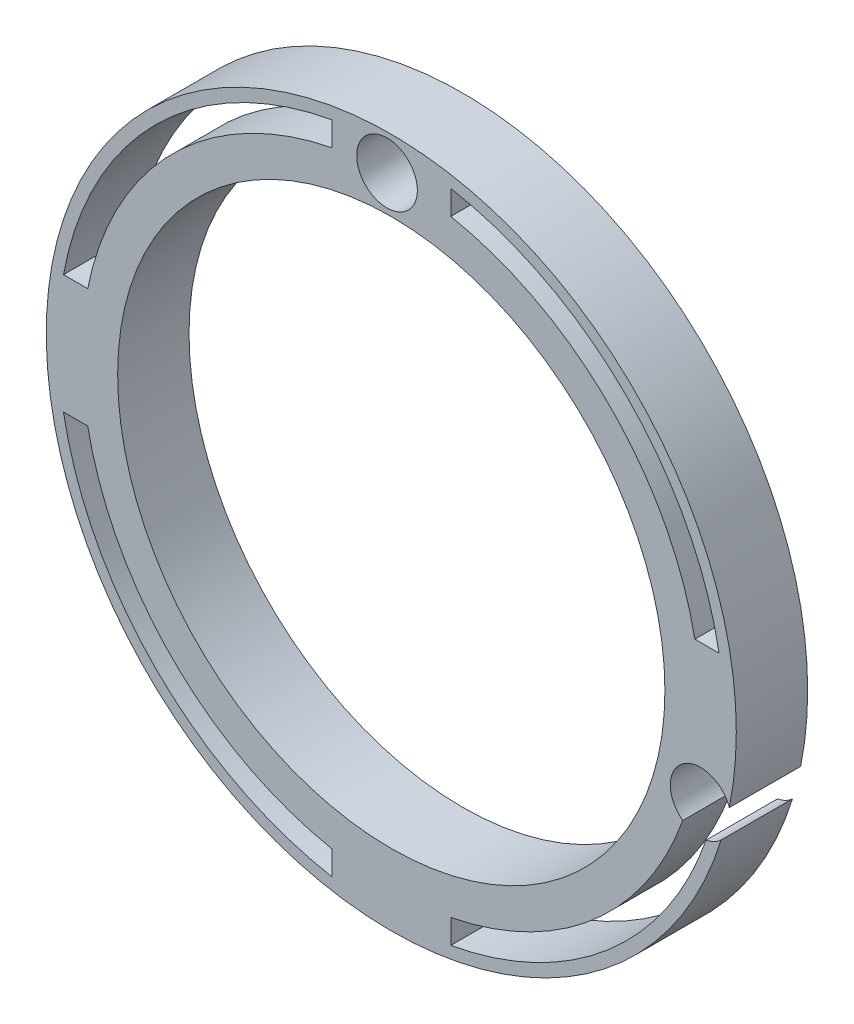
ISO-10303-21;
HEADER;
FILE_DESCRIPTION(('STEP AP214'),'2;1');
FILE_NAME('part.step','',(''),(''),'','','');
FILE_SCHEMA(('AUTOMOTIVE_DESIGN { 1 0 10303 214 1 1 1 1 }'));
ENDSEC;
DATA;
#1=APPLICATION_CONTEXT('core data for automotive mechanical design processes');
#2=APPLICATION_PROTOCOL_DEFINITION('international standard','automotive_design',2000,#1);
#3=PRODUCT_CONTEXT('',#1,'mechanical');
#4=PRODUCT('Part','Part','',(#3));
#5=PRODUCT_RELATED_PRODUCT_CATEGORY('part','',(#4));
#6=PRODUCT_DEFINITION_FORMATION('','',#4);
#7=PRODUCT_DEFINITION_CONTEXT('part definition',#1,'design');
#8=PRODUCT_DEFINITION('design','',#6,#7);
#9=PRODUCT_DEFINITION_SHAPE('','',#8);
#10=(LENGTH_UNIT() NAMED_UNIT(*) SI_UNIT(.MILLI.,.METRE.));
#11=(NAMED_UNIT(*) PLANE_ANGLE_UNIT() SI_UNIT($,.RADIAN.));
#12=(NAMED_UNIT(*) SI_UNIT($,.STERADIAN.) SOLID_ANGLE_UNIT());
#13=UNCERTAINTY_MEASURE_WITH_UNIT(LENGTH_MEASURE(1.E-05),#10,'distance_accuracy_value','');
#14=(GEOMETRIC_REPRESENTATION_CONTEXT(3) GLOBAL_UNCERTAINTY_ASSIGNED_CONTEXT((#13)) GLOBAL_UNIT_ASSIGNED_CONTEXT((#10,
#11,#12)) REPRESENTATION_CONTEXT('',''));
#15=CARTESIAN_POINT('',(0.,0.,0.));
#16=DIRECTION('',(0.,0.,1.));
#17=DIRECTION('',(1.,0.,0.));
#18=AXIS2_PLACEMENT_3D('',#15,#16,#17);
#19=CARTESIAN_POINT('',(259.301545348096,-148.573704322228,22.865));
#20=DIRECTION('',(0.,0.,-1.));
#21=DIRECTION('',(-1.,0.,0.));
#22=AXIS2_PLACEMENT_3D('',#19,#20,#21);
#23=CYLINDRICAL_SURFACE('',#22,27.5);
#24=CARTESIAN_POINT('',(259.301545348096,-148.573704322228,2.));
#25=DIRECTION('',(0.,0.,-1.));
#26=DIRECTION('',(-1.,0.,0.));
#27=AXIS2_PLACEMENT_3D('',#24,#25,#26);
#28=CIRCLE('',#27,27.5);
#29=CARTESIAN_POINT('',(261.04599148136,-121.12908904549,2.));
#30=VERTEX_POINT('',#29);
#31=CARTESIAN_POINT('',(264.301545348096,-121.532069756248,2.));
#32=VERTEX_POINT('',#31);
#33=EDGE_CURVE('E292',#30,#32,#28,.T.);
#34=ORIENTED_EDGE('',*,*,#33,.F.);
#35=DIRECTION('',(0.,0.,1.));
#36=VECTOR('',#35,1.);
#37=CARTESIAN_POINT('',(261.04599148136,-121.12908904549,3.00000000000001));
#38=LINE('',#37,#36);
#39=CARTESIAN_POINT('',(261.04599148136,-121.12908904549,0.));
#40=VERTEX_POINT('',#39);
#41=EDGE_CURVE('E449',#30,#40,#38,.F.);
#42=ORIENTED_EDGE('',*,*,#41,.T.);
#43=CARTESIAN_POINT('',(259.301545348096,-148.573704322228,0.));
#44=DIRECTION('',(0.,0.,-1.));
#45=DIRECTION('',(-1.,0.,0.));
#46=AXIS2_PLACEMENT_3D('',#43,#44,#45);
#47=CIRCLE('',#46,27.5);
#48=CARTESIAN_POINT('',(264.301545348096,-121.532069756248,0.));
#49=VERTEX_POINT('',#48);
#50=EDGE_CURVE('E297',#40,#49,#47,.T.);
#51=ORIENTED_EDGE('',*,*,#50,.T.);
#52=DIRECTION('',(0.,0.,-1.));
#53=VECTOR('',#52,1.);
#54=CARTESIAN_POINT('',(264.301545348096,-121.532069756248,22.865));
#55=LINE('',#54,#53);
#56=EDGE_CURVE('E419',#49,#32,#55,.F.);
#57=ORIENTED_EDGE('',*,*,#56,.T.);
#58=EDGE_LOOP('',(#34,#42,#51,#57));
#59=FACE_BOUND('',#58,.T.);
#60=ADVANCED_FACE('F37',(#59),#23,.F.);
#61=CARTESIAN_POINT('',(259.301545348096,-121.073704322228,2.));
#62=DIRECTION('',(0.,0.,1.));
#63=DIRECTION('',(1.,0.,0.));
#64=AXIS2_PLACEMENT_3D('',#61,#62,#63);
#65=PLANE('',#64);
#66=CARTESIAN_POINT('',(254.301545348096,-121.532069756248,2.));
#67=VERTEX_POINT('',#66);
#68=CARTESIAN_POINT('',(256.804472713702,-121.187309374032,2.));
#69=VERTEX_POINT('',#68);
#70=EDGE_CURVE('E293',#67,#69,#28,.T.);
#71=ORIENTED_EDGE('',*,*,#70,.T.);
#72=CARTESIAN_POINT('',(258.944661735171,-122.573704322228,2.));
#73=DIRECTION('',(0.,0.,1.));
#74=DIRECTION('',(1.,0.,0.));
#75=AXIS2_PLACEMENT_3D('',#72,#73,#74);
#76=CIRCLE('',#75,2.54999999999999);
#77=CARTESIAN_POINT('',(256.968293712142,-124.18506071904,2.));
#78=VERTEX_POINT('',#77);
#79=EDGE_CURVE('E511',#69,#78,#76,.T.);
#80=ORIENTED_EDGE('',*,*,#79,.T.);
#81=CARTESIAN_POINT('',(259.301545348096,-148.573704322228,2.));
#82=DIRECTION('',(0.,0.,-1.));
#83=DIRECTION('',(-1.,0.,0.));
#84=AXIS2_PLACEMENT_3D('',#81,#82,#83);
#85=CIRCLE('',#84,24.5);
#86=CARTESIAN_POINT('',(282.777814398956,-155.581898915104,2.));
#87=VERTEX_POINT('',#86);
#88=EDGE_CURVE('E285',#87,#78,#85,.T.);
#89=ORIENTED_EDGE('',*,*,#88,.F.);
#90=CARTESIAN_POINT('',(285.301545348096,-155.216820709303,2.));
#91=DIRECTION('',(0.,0.,1.));
#92=DIRECTION('',(1.,0.,0.));
#93=AXIS2_PLACEMENT_3D('',#90,#91,#92);
#94=CIRCLE('',#93,2.54999999999999);
#95=CARTESIAN_POINT('',(283.801029339014,-157.278604331919,2.));
#96=VERTEX_POINT('',#95);
#97=EDGE_CURVE('E442',#87,#96,#94,.T.);
#98=ORIENTED_EDGE('',*,*,#97,.T.);
#99=CARTESIAN_POINT('',(259.301545348096,-148.573704322228,2.));
#100=DIRECTION('',(0.,0.,1.));
#101=DIRECTION('',(1.,0.,0.));
#102=AXIS2_PLACEMENT_3D('',#99,#100,#101);
#103=CIRCLE('',#102,26.);
#104=CARTESIAN_POINT('',(264.301545348096,-174.088405966574,2.));
#105=VERTEX_POINT('',#104);
#106=EDGE_CURVE('E275',#96,#105,#103,.F.);
#107=ORIENTED_EDGE('',*,*,#106,.T.);
#108=DIRECTION('',(0.,-1.,0.));
#109=VECTOR('',#108,1.);
#110=CARTESIAN_POINT('',(264.301545348096,-121.073704322228,2.));
#111=LINE('',#110,#109);
#112=CARTESIAN_POINT('',(264.301545348096,-175.615338888208,2.));
#113=VERTEX_POINT('',#112);
#114=EDGE_CURVE('E429',#105,#113,#111,.T.);
#115=ORIENTED_EDGE('',*,*,#114,.T.);
#116=CARTESIAN_POINT('',(254.301545348096,-175.615338888208,2.));
#117=VERTEX_POINT('',#116);
#118=EDGE_CURVE('E291',#113,#117,#28,.T.);
#119=ORIENTED_EDGE('',*,*,#118,.T.);
#120=DIRECTION('',(0.,1.,0.));
#121=VECTOR('',#120,1.);
#122=CARTESIAN_POINT('',(254.301545348096,-121.073704322228,2.));
#123=LINE('',#122,#121);
#124=CARTESIAN_POINT('',(254.301545348096,-174.088405966574,2.));
#125=VERTEX_POINT('',#124);
#126=EDGE_CURVE('E394',#117,#125,#123,.T.);
#127=ORIENTED_EDGE('',*,*,#126,.T.);
#128=CARTESIAN_POINT('',(259.301545348096,-148.573704322228,2.));
#129=DIRECTION('',(0.,0.,1.));
#130=DIRECTION('',(1.,0.,0.));
#131=AXIS2_PLACEMENT_3D('',#128,#129,#130);
#132=CIRCLE('',#131,26.);
#133=CARTESIAN_POINT('',(233.786843703749,-153.573704322228,2.));
#134=VERTEX_POINT('',#133);
#135=EDGE_CURVE('E400',#125,#134,#132,.F.);
#136=ORIENTED_EDGE('',*,*,#135,.T.);
#137=DIRECTION('',(-1.,0.,0.));
#138=VECTOR('',#137,1.);
#139=CARTESIAN_POINT('',(259.301545348096,-153.573704322228,2.));
#140=LINE('',#139,#138);
#141=CARTESIAN_POINT('',(232.259910782116,-153.573704322228,2.));
#142=VERTEX_POINT('',#141);
#143=EDGE_CURVE('E383',#134,#142,#140,.T.);
#144=ORIENTED_EDGE('',*,*,#143,.T.);
#145=CARTESIAN_POINT('',(232.259910782116,-143.573704322228,2.));
#146=VERTEX_POINT('',#145);
#147=EDGE_CURVE('E289',#142,#146,#28,.T.);
#148=ORIENTED_EDGE('',*,*,#147,.T.);
#149=DIRECTION('',(1.,0.,0.));
#150=VECTOR('',#149,1.);
#151=CARTESIAN_POINT('',(259.301545348096,-143.573704322228,2.));
#152=LINE('',#151,#150);
#153=CARTESIAN_POINT('',(233.786843703749,-143.573704322228,2.));
#154=VERTEX_POINT('',#153);
#155=EDGE_CURVE('E403',#146,#154,#152,.T.);
#156=ORIENTED_EDGE('',*,*,#155,.T.);
#157=CARTESIAN_POINT('',(259.301545348096,-148.573704322228,2.));
#158=DIRECTION('',(0.,0.,1.));
#159=DIRECTION('',(1.,0.,0.));
#160=AXIS2_PLACEMENT_3D('',#157,#158,#159);
#161=CIRCLE('',#160,26.);
#162=CARTESIAN_POINT('',(254.301545348096,-123.059002677881,2.));
#163=VERTEX_POINT('',#162);
#164=EDGE_CURVE('E408',#154,#163,#161,.F.);
#165=ORIENTED_EDGE('',*,*,#164,.T.);
#166=DIRECTION('',(0.,1.,0.));
#167=VECTOR('',#166,1.);
#168=CARTESIAN_POINT('',(254.301545348096,-121.073704322228,2.));
#169=LINE('',#168,#167);
#170=EDGE_CURVE('E411',#163,#67,#169,.T.);
#171=ORIENTED_EDGE('',*,*,#170,.T.);
#172=EDGE_LOOP('',(#71,#80,#89,#98,#107,#115,#119,#127,#136,#144,#148,#156,#165,#171));
#173=FACE_BOUND('',#172,.T.);
#174=ADVANCED_FACE('F438',(#173),#65,.F.);
#175=CARTESIAN_POINT('',(259.301545348096,-148.573704322228,22.865));
#176=DIRECTION('',(0.,0.,-1.));
#177=DIRECTION('',(-1.,0.,0.));
#178=AXIS2_PLACEMENT_3D('',#175,#176,#177);
#179=CYLINDRICAL_SURFACE('',#178,24.5);
#180=CARTESIAN_POINT('',(259.301545348096,-148.573704322228,0.));
#181=DIRECTION('',(0.,0.,-1.));
#182=DIRECTION('',(-1.,0.,0.));
#183=AXIS2_PLACEMENT_3D('',#180,#181,#182);
#184=CIRCLE('',#183,24.5);
#185=CARTESIAN_POINT('',(260.964512725555,-124.130207446749,0.));
#186=VERTEX_POINT('',#185);
#187=CARTESIAN_POINT('',(283.262258040923,-153.685870912999,0.));
#188=VERTEX_POINT('',#187);
#189=EDGE_CURVE('E284',#186,#188,#184,.T.);
#190=ORIENTED_EDGE('',*,*,#189,.F.);
#191=DIRECTION('',(0.,0.,1.));
#192=VECTOR('',#191,1.);
#193=CARTESIAN_POINT('',(260.964512725555,-124.130207446749,3.00000000000001));
#194=LINE('',#193,#192);
#195=CARTESIAN_POINT('',(260.964512725555,-124.130207446749,2.));
#196=VERTEX_POINT('',#195);
#197=EDGE_CURVE('E52',#186,#196,#194,.T.);
#198=ORIENTED_EDGE('',*,*,#197,.T.);
#199=CARTESIAN_POINT('',(283.262258040923,-153.685870912999,2.));
#200=VERTEX_POINT('',#199);
#201=EDGE_CURVE('E288',#196,#200,#85,.T.);
#202=ORIENTED_EDGE('',*,*,#201,.T.);
#203=DIRECTION('',(0.,0.,1.));
#204=VECTOR('',#203,1.);
#205=CARTESIAN_POINT('',(283.262258040923,-153.685870912999,3.00000000000001));
#206=LINE('',#205,#204);
#207=EDGE_CURVE('E519',#200,#188,#206,.F.);
#208=ORIENTED_EDGE('',*,*,#207,.T.);
#209=EDGE_LOOP('',(#190,#198,#202,#208));
#210=FACE_BOUND('',#209,.T.);
#211=ADVANCED_FACE('F535',(#210),#179,.T.);
#212=CARTESIAN_POINT('',(286.343179914076,-143.573704322228,0.));
#213=VERTEX_POINT('',#212);
#214=CARTESIAN_POINT('',(286.452489827508,-152.941336847503,0.));
#215=VERTEX_POINT('',#214);
#216=EDGE_CURVE('E303',#213,#215,#47,.T.);
#217=ORIENTED_EDGE('',*,*,#216,.T.);
#218=DIRECTION('',(0.,0.,1.));
#219=VECTOR('',#218,1.);
#220=CARTESIAN_POINT('',(286.452489827508,-152.941336847503,3.00000000000001));
#221=LINE('',#220,#219);
#222=CARTESIAN_POINT('',(286.452489827508,-152.941336847503,2.));
#223=VERTEX_POINT('',#222);
#224=EDGE_CURVE('E318',#215,#223,#221,.T.);
#225=ORIENTED_EDGE('',*,*,#224,.T.);
#226=CARTESIAN_POINT('',(286.343179914076,-143.573704322228,2.));
#227=VERTEX_POINT('',#226);
#228=EDGE_CURVE('E305',#227,#223,#28,.T.);
#229=ORIENTED_EDGE('',*,*,#228,.F.);
#230=DIRECTION('',(0.,0.,-1.));
#231=VECTOR('',#230,1.);
#232=CARTESIAN_POINT('',(286.343179914076,-143.573704322228,22.865));
#233=LINE('',#232,#231);
#234=EDGE_CURVE('E320',#227,#213,#233,.T.);
#235=ORIENTED_EDGE('',*,*,#234,.T.);
#236=EDGE_LOOP('',(#217,#225,#229,#235));
#237=FACE_BOUND('',#236,.T.);
#238=ADVANCED_FACE('F316',(#237),#23,.F.);
#239=ORIENTED_EDGE('',*,*,#118,.F.);
#240=DIRECTION('',(0.,0.,-1.));
#241=VECTOR('',#240,1.);
#242=CARTESIAN_POINT('',(264.301545348096,-175.615338888208,22.865));
#243=LINE('',#242,#241);
#244=CARTESIAN_POINT('',(264.301545348096,-175.615338888208,0.));
#245=VERTEX_POINT('',#244);
#246=EDGE_CURVE('E432',#113,#245,#243,.T.);
#247=ORIENTED_EDGE('',*,*,#246,.T.);
#248=CARTESIAN_POINT('',(254.301545348096,-175.615338888208,0.));
#249=VERTEX_POINT('',#248);
#250=EDGE_CURVE('E296',#245,#249,#47,.T.);
#251=ORIENTED_EDGE('',*,*,#250,.T.);
#252=DIRECTION('',(0.,0.,-1.));
#253=VECTOR('',#252,1.);
#254=CARTESIAN_POINT('',(254.301545348096,-175.615338888208,22.865));
#255=LINE('',#254,#253);
#256=EDGE_CURVE('E397',#249,#117,#255,.F.);
#257=ORIENTED_EDGE('',*,*,#256,.T.);
#258=EDGE_LOOP('',(#239,#247,#251,#257));
#259=FACE_BOUND('',#258,.T.);
#260=ADVANCED_FACE('F543',(#259),#23,.F.);
#261=CARTESIAN_POINT('',(254.301545348096,-121.532069756248,0.));
#262=VERTEX_POINT('',#261);
#263=CARTESIAN_POINT('',(256.804472713702,-121.187309374032,0.));
#264=VERTEX_POINT('',#263);
#265=EDGE_CURVE('E45',#262,#264,#47,.T.);
#266=ORIENTED_EDGE('',*,*,#265,.T.);
#267=DIRECTION('',(0.,0.,1.));
#268=VECTOR('',#267,1.);
#269=CARTESIAN_POINT('',(256.804472713702,-121.187309374032,3.00000000000001));
#270=LINE('',#269,#268);
#271=EDGE_CURVE('E509',#264,#69,#270,.T.);
#272=ORIENTED_EDGE('',*,*,#271,.T.);
#273=ORIENTED_EDGE('',*,*,#70,.F.);
#274=DIRECTION('',(0.,0.,-1.));
#275=VECTOR('',#274,1.);
#276=CARTESIAN_POINT('',(254.301545348096,-121.532069756248,22.865));
#277=LINE('',#276,#275);
#278=EDGE_CURVE('E414',#67,#262,#277,.T.);
#279=ORIENTED_EDGE('',*,*,#278,.T.);
#280=EDGE_LOOP('',(#266,#272,#273,#279));
#281=FACE_BOUND('',#280,.T.);
#282=ADVANCED_FACE('F582',(#281),#23,.F.);
#283=CARTESIAN_POINT('',(259.301545348096,-119.573704322228,0.));
#284=DIRECTION('',(0.,0.,1.));
#285=DIRECTION('',(1.,0.,0.));
#286=AXIS2_PLACEMENT_3D('',#283,#284,#285);
#287=PLANE('',#286);
#288=ORIENTED_EDGE('',*,*,#50,.F.);
#289=CARTESIAN_POINT('',(258.944661735171,-122.573704322228,0.));
#290=DIRECTION('',(0.,0.,1.));
#291=DIRECTION('',(1.,0.,0.));
#292=AXIS2_PLACEMENT_3D('',#289,#290,#291);
#293=CIRCLE('',#292,2.54999999999999);
#294=EDGE_CURVE('E526',#40,#264,#293,.T.);
#295=ORIENTED_EDGE('',*,*,#294,.T.);
#296=ORIENTED_EDGE('',*,*,#265,.F.);
#297=DIRECTION('',(0.,1.,0.));
#298=VECTOR('',#297,1.);
#299=CARTESIAN_POINT('',(254.301545348096,-121.023749694316,0.));
#300=LINE('',#299,#298);
#301=CARTESIAN_POINT('',(254.301545348096,-121.023749694316,0.));
#302=VERTEX_POINT('',#301);
#303=EDGE_CURVE('E485',#262,#302,#300,.T.);
#304=ORIENTED_EDGE('',*,*,#303,.T.);
#305=CARTESIAN_POINT('',(259.301545348096,-148.573704322228,0.));
#306=DIRECTION('',(0.,0.,1.));
#307=DIRECTION('',(1.,0.,0.));
#308=AXIS2_PLACEMENT_3D('',#305,#306,#307);
#309=CIRCLE('',#308,28.);
#310=CARTESIAN_POINT('',(231.751590720184,-143.573704322228,0.));
#311=VERTEX_POINT('',#310);
#312=EDGE_CURVE('E493',#302,#311,#309,.T.);
#313=ORIENTED_EDGE('',*,*,#312,.T.);
#314=DIRECTION('',(1.,0.,0.));
#315=VECTOR('',#314,1.);
#316=CARTESIAN_POINT('',(233.786843703749,-143.573704322228,0.));
#317=LINE('',#316,#315);
#318=CARTESIAN_POINT('',(232.259910782116,-143.573704322228,0.));
#319=VERTEX_POINT('',#318);
#320=EDGE_CURVE('E503',#311,#319,#317,.T.);
#321=ORIENTED_EDGE('',*,*,#320,.T.);
#322=CARTESIAN_POINT('',(232.259910782116,-153.573704322228,0.));
#323=VERTEX_POINT('',#322);
#324=EDGE_CURVE('E294',#323,#319,#47,.T.);
#325=ORIENTED_EDGE('',*,*,#324,.F.);
#326=DIRECTION('',(-1.,0.,0.));
#327=VECTOR('',#326,1.);
#328=CARTESIAN_POINT('',(233.786843703749,-153.573704322228,0.));
#329=LINE('',#328,#327);
#330=CARTESIAN_POINT('',(231.751590720184,-153.573704322228,0.));
#331=VERTEX_POINT('',#330);
#332=EDGE_CURVE('E359',#323,#331,#329,.T.);
#333=ORIENTED_EDGE('',*,*,#332,.T.);
#334=CARTESIAN_POINT('',(259.301545348096,-148.573704322228,0.));
#335=DIRECTION('',(0.,0.,1.));
#336=DIRECTION('',(1.,0.,0.));
#337=AXIS2_PLACEMENT_3D('',#334,#335,#336);
#338=CIRCLE('',#337,28.);
#339=CARTESIAN_POINT('',(254.301545348096,-176.123658950139,0.));
#340=VERTEX_POINT('',#339);
#341=EDGE_CURVE('E362',#331,#340,#338,.T.);
#342=ORIENTED_EDGE('',*,*,#341,.T.);
#343=DIRECTION('',(0.,1.,0.));
#344=VECTOR('',#343,1.);
#345=CARTESIAN_POINT('',(254.301545348096,-174.088405966574,0.));
#346=LINE('',#345,#344);
#347=EDGE_CURVE('E366',#340,#249,#346,.T.);
#348=ORIENTED_EDGE('',*,*,#347,.T.);
#349=ORIENTED_EDGE('',*,*,#250,.F.);
#350=DIRECTION('',(0.,-1.,0.));
#351=VECTOR('',#350,1.);
#352=CARTESIAN_POINT('',(264.301545348096,-174.088405966574,0.));
#353=LINE('',#352,#351);
#354=CARTESIAN_POINT('',(264.301545348096,-176.123658950139,0.));
#355=VERTEX_POINT('',#354);
#356=EDGE_CURVE('E347',#245,#355,#353,.T.);
#357=ORIENTED_EDGE('',*,*,#356,.T.);
#358=CARTESIAN_POINT('',(259.301545348096,-148.573704322228,0.));
#359=DIRECTION('',(0.,0.,1.));
#360=DIRECTION('',(1.,0.,0.));
#361=AXIS2_PLACEMENT_3D('',#358,#359,#360);
#362=CIRCLE('',#361,28.);
#363=CARTESIAN_POINT('',(285.764015629492,-157.724533060994,0.));
#364=VERTEX_POINT('',#363);
#365=EDGE_CURVE('E337',#355,#364,#362,.T.);
#366=ORIENTED_EDGE('',*,*,#365,.T.);
#367=CARTESIAN_POINT('',(285.301545348096,-155.216820709303,0.));
#368=DIRECTION('',(0.,0.,1.));
#369=DIRECTION('',(1.,0.,0.));
#370=AXIS2_PLACEMENT_3D('',#367,#368,#369);
#371=CIRCLE('',#370,2.54999999999999);
#372=CARTESIAN_POINT('',(287.019391995434,-157.101363862491,0.));
#373=VERTEX_POINT('',#372);
#374=EDGE_CURVE('E264',#364,#373,#371,.T.);
#375=ORIENTED_EDGE('',*,*,#374,.T.);
#376=CARTESIAN_POINT('',(259.301545348096,-148.573704322228,0.));
#377=DIRECTION('',(0.,0.,-1.));
#378=DIRECTION('',(-1.,0.,0.));
#379=AXIS2_PLACEMENT_3D('',#376,#377,#378);
#380=CIRCLE('',#379,29.);
#381=CARTESIAN_POINT('',(287.712849009016,-154.387293943709,0.));
#382=VERTEX_POINT('',#381);
#383=EDGE_CURVE('E270',#373,#382,#380,.T.);
#384=ORIENTED_EDGE('',*,*,#383,.T.);
#385=EDGE_CURVE('E247',#382,#215,#371,.T.);
#386=ORIENTED_EDGE('',*,*,#385,.T.);
#387=ORIENTED_EDGE('',*,*,#216,.F.);
#388=DIRECTION('',(1.,0.,0.));
#389=VECTOR('',#388,1.);
#390=CARTESIAN_POINT('',(286.851499976007,-143.573704322228,0.));
#391=LINE('',#390,#389);
#392=CARTESIAN_POINT('',(286.851499976007,-143.573704322228,0.));
#393=VERTEX_POINT('',#392);
#394=EDGE_CURVE('E325',#213,#393,#391,.T.);
#395=ORIENTED_EDGE('',*,*,#394,.T.);
#396=CARTESIAN_POINT('',(259.301545348096,-148.573704322228,0.));
#397=DIRECTION('',(0.,0.,1.));
#398=DIRECTION('',(1.,0.,0.));
#399=AXIS2_PLACEMENT_3D('',#396,#397,#398);
#400=CIRCLE('',#399,28.);
#401=CARTESIAN_POINT('',(264.301545348096,-121.023749694316,0.));
#402=VERTEX_POINT('',#401);
#403=EDGE_CURVE('E468',#393,#402,#400,.T.);
#404=ORIENTED_EDGE('',*,*,#403,.T.);
#405=DIRECTION('',(0.,-1.,0.));
#406=VECTOR('',#405,1.);
#407=CARTESIAN_POINT('',(264.301545348096,-121.023749694316,0.));
#408=LINE('',#407,#406);
#409=EDGE_CURVE('E477',#402,#49,#408,.T.);
#410=ORIENTED_EDGE('',*,*,#409,.T.);
#411=EDGE_LOOP('',(#288,#295,#296,#304,#313,#321,#325,#333,#342,#348,#349,#357,#366,#375,#384,
#386,#387,#395,#404,#410));
#412=FACE_BOUND('',#411,.T.);
#413=ADVANCED_FACE('F39',(#412),#287,.F.);
#414=ORIENTED_EDGE('',*,*,#324,.T.);
#415=DIRECTION('',(0.,0.,-1.));
#416=VECTOR('',#415,1.);
#417=CARTESIAN_POINT('',(232.259910782116,-143.573704322228,22.865));
#418=LINE('',#417,#416);
#419=EDGE_CURVE('E406',#319,#146,#418,.F.);
#420=ORIENTED_EDGE('',*,*,#419,.T.);
#421=ORIENTED_EDGE('',*,*,#147,.F.);
#422=DIRECTION('',(0.,0.,-1.));
#423=VECTOR('',#422,1.);
#424=CARTESIAN_POINT('',(232.259910782116,-153.573704322228,22.865));
#425=LINE('',#424,#423);
#426=EDGE_CURVE('E392',#142,#323,#425,.T.);
#427=ORIENTED_EDGE('',*,*,#426,.T.);
#428=EDGE_LOOP('',(#414,#420,#421,#427));
#429=FACE_BOUND('',#428,.T.);
#430=ADVANCED_FACE('F564',(#429),#23,.F.);
#431=ORIENTED_EDGE('',*,*,#201,.F.);
#432=EDGE_CURVE('E451',#196,#30,#76,.T.);
#433=ORIENTED_EDGE('',*,*,#432,.T.);
#434=ORIENTED_EDGE('',*,*,#33,.T.);
#435=DIRECTION('',(0.,-1.,0.));
#436=VECTOR('',#435,1.);
#437=CARTESIAN_POINT('',(264.301545348096,-121.073704322228,2.));
#438=LINE('',#437,#436);
#439=CARTESIAN_POINT('',(264.301545348096,-123.059002677881,2.));
#440=VERTEX_POINT('',#439);
#441=EDGE_CURVE('E416',#32,#440,#438,.T.);
#442=ORIENTED_EDGE('',*,*,#441,.T.);
#443=CARTESIAN_POINT('',(259.301545348096,-148.573704322228,2.));
#444=DIRECTION('',(0.,0.,1.));
#445=DIRECTION('',(1.,0.,0.));
#446=AXIS2_PLACEMENT_3D('',#443,#444,#445);
#447=CIRCLE('',#446,26.);
#448=CARTESIAN_POINT('',(284.816246992442,-143.573704322228,2.));
#449=VERTEX_POINT('',#448);
#450=EDGE_CURVE('E422',#440,#449,#447,.F.);
#451=ORIENTED_EDGE('',*,*,#450,.T.);
#452=DIRECTION('',(1.,0.,0.));
#453=VECTOR('',#452,1.);
#454=CARTESIAN_POINT('',(259.301545348096,-143.573704322228,2.));
#455=LINE('',#454,#453);
#456=EDGE_CURVE('E425',#449,#227,#455,.T.);
#457=ORIENTED_EDGE('',*,*,#456,.T.);
#458=ORIENTED_EDGE('',*,*,#228,.T.);
#459=EDGE_CURVE('E518',#223,#200,#94,.T.);
#460=ORIENTED_EDGE('',*,*,#459,.T.);
#461=EDGE_LOOP('',(#431,#433,#434,#442,#451,#457,#458,#460));
#462=FACE_BOUND('',#461,.T.);
#463=ADVANCED_FACE('F540',(#462),#65,.F.);
#464=ORIENTED_EDGE('',*,*,#88,.T.);
#465=DIRECTION('',(0.,0.,1.));
#466=VECTOR('',#465,1.);
#467=CARTESIAN_POINT('',(256.968293712142,-124.18506071904,3.00000000000001));
#468=LINE('',#467,#466);
#469=CARTESIAN_POINT('',(256.968293712142,-124.18506071904,0.));
#470=VERTEX_POINT('',#469);
#471=EDGE_CURVE('E514',#78,#470,#468,.F.);
#472=ORIENTED_EDGE('',*,*,#471,.T.);
#473=CARTESIAN_POINT('',(282.777814398956,-155.581898915104,0.));
#474=VERTEX_POINT('',#473);
#475=EDGE_CURVE('E281',#474,#470,#184,.T.);
#476=ORIENTED_EDGE('',*,*,#475,.F.);
#477=DIRECTION('',(0.,0.,1.));
#478=VECTOR('',#477,1.);
#479=CARTESIAN_POINT('',(282.777814398956,-155.581898915104,3.00000000000001));
#480=LINE('',#479,#478);
#481=EDGE_CURVE('E253',#474,#87,#480,.T.);
#482=ORIENTED_EDGE('',*,*,#481,.T.);
#483=EDGE_LOOP('',(#464,#472,#476,#482));
#484=FACE_BOUND('',#483,.T.);
#485=ADVANCED_FACE('F585',(#484),#179,.T.);
#486=CARTESIAN_POINT('',(259.301545348096,-124.073704322228,0.));
#487=DIRECTION('',(0.,0.,1.));
#488=DIRECTION('',(1.,0.,0.));
#489=AXIS2_PLACEMENT_3D('',#486,#487,#488);
#490=PLANE('',#489);
#491=CARTESIAN_POINT('',(259.301545348096,-148.573704322228,0.));
#492=DIRECTION('',(0.,0.,-1.));
#493=DIRECTION('',(-1.,0.,0.));
#494=AXIS2_PLACEMENT_3D('',#491,#492,#493);
#495=CIRCLE('',#494,23.);
#496=CARTESIAN_POINT('',(236.301545348096,-148.573704322228,0.));
#497=VERTEX_POINT('',#496);
#498=EDGE_CURVE('E273',#497,#497,#495,.T.);
#499=ORIENTED_EDGE('',*,*,#498,.F.);
#500=EDGE_LOOP('',(#499));
#501=FACE_BOUND('',#500,.T.);
#502=ORIENTED_EDGE('',*,*,#475,.T.);
#503=EDGE_CURVE('E331',#470,#186,#293,.T.);
#504=ORIENTED_EDGE('',*,*,#503,.T.);
#505=ORIENTED_EDGE('',*,*,#189,.T.);
#506=EDGE_CURVE('E328',#188,#474,#371,.T.);
#507=ORIENTED_EDGE('',*,*,#506,.T.);
#508=EDGE_LOOP('',(#502,#504,#505,#507));
#509=FACE_BOUND('',#508,.T.);
#510=ADVANCED_FACE('F532',(#501,#509),#490,.F.);
#511=CARTESIAN_POINT('',(259.301545348096,-148.573704322228,22.865));
#512=DIRECTION('',(0.,0.,-1.));
#513=DIRECTION('',(-1.,0.,0.));
#514=AXIS2_PLACEMENT_3D('',#511,#512,#513);
#515=CYLINDRICAL_SURFACE('',#514,23.);
#516=CARTESIAN_POINT('',(259.301545348096,-148.573704322228,6.00000000000003));
#517=DIRECTION('',(0.,0.,-1.));
#518=DIRECTION('',(-1.,0.,0.));
#519=AXIS2_PLACEMENT_3D('',#516,#517,#518);
#520=CIRCLE('',#519,23.);
#521=CARTESIAN_POINT('',(236.301545348096,-148.573704322228,6.00000000000003));
#522=VERTEX_POINT('',#521);
#523=EDGE_CURVE('E269',#522,#522,#520,.T.);
#524=ORIENTED_EDGE('',*,*,#523,.F.);
#525=EDGE_LOOP('',(#524));
#526=FACE_BOUND('',#525,.T.);
#527=ORIENTED_EDGE('',*,*,#498,.T.);
#528=EDGE_LOOP('',(#527));
#529=FACE_BOUND('',#528,.T.);
#530=ADVANCED_FACE('F592',(#526,#529),#515,.F.);
#531=CARTESIAN_POINT('',(259.301545348096,-119.573704322228,6.00000000000001));
#532=DIRECTION('',(0.,0.,-1.));
#533=DIRECTION('',(-1.,0.,0.));
#534=AXIS2_PLACEMENT_3D('',#531,#532,#533);
#535=PLANE('',#534);
#536=CARTESIAN_POINT('',(258.944661735171,-122.573704322228,6.00000000000001));
#537=DIRECTION('',(0.,0.,1.));
#538=DIRECTION('',(1.,0.,0.));
#539=AXIS2_PLACEMENT_3D('',#536,#537,#538);
#540=CIRCLE('',#539,2.54999999999999);
#541=CARTESIAN_POINT('',(261.494661735171,-122.573704322228,6.00000000000001));
#542=VERTEX_POINT('',#541);
#543=EDGE_CURVE('E327',#542,#542,#540,.T.);
#544=ORIENTED_EDGE('',*,*,#543,.F.);
#545=EDGE_LOOP('',(#544));
#546=FACE_BOUND('',#545,.T.);
#547=CARTESIAN_POINT('',(259.301545348096,-148.573704322228,6.));
#548=DIRECTION('',(0.,0.,-1.));
#549=DIRECTION('',(-1.,0.,0.));
#550=AXIS2_PLACEMENT_3D('',#547,#548,#549);
#551=CIRCLE('',#550,29.);
#552=CARTESIAN_POINT('',(287.019391995434,-157.101363862491,6.00000000000001));
#553=VERTEX_POINT('',#552);
#554=CARTESIAN_POINT('',(287.712849009016,-154.387293943709,6.00000000000001));
#555=VERTEX_POINT('',#554);
#556=EDGE_CURVE('E261',#553,#555,#551,.T.);
#557=ORIENTED_EDGE('',*,*,#556,.F.);
#558=CARTESIAN_POINT('',(285.301545348096,-155.216820709303,6.00000000000001));
#559=DIRECTION('',(0.,0.,1.));
#560=DIRECTION('',(1.,0.,0.));
#561=AXIS2_PLACEMENT_3D('',#558,#559,#560);
#562=CIRCLE('',#561,2.54999999999999);
#563=CARTESIAN_POINT('',(285.764015629492,-157.724533060994,6.00000000000001));
#564=VERTEX_POINT('',#563);
#565=EDGE_CURVE('E265',#564,#553,#562,.T.);
#566=ORIENTED_EDGE('',*,*,#565,.F.);
#567=CARTESIAN_POINT('',(259.301545348096,-148.573704322228,6.00000000000001));
#568=DIRECTION('',(0.,0.,1.));
#569=DIRECTION('',(1.,0.,0.));
#570=AXIS2_PLACEMENT_3D('',#567,#568,#569);
#571=CIRCLE('',#570,28.);
#572=CARTESIAN_POINT('',(264.301545348096,-176.123658950139,6.00000000000001));
#573=VERTEX_POINT('',#572);
#574=EDGE_CURVE('E344',#573,#564,#571,.T.);
#575=ORIENTED_EDGE('',*,*,#574,.F.);
#576=DIRECTION('',(0.,-1.,0.));
#577=VECTOR('',#576,1.);
#578=CARTESIAN_POINT('',(264.301545348096,-174.088405966574,6.00000000000001));
#579=LINE('',#578,#577);
#580=CARTESIAN_POINT('',(264.301545348096,-174.088405966574,6.00000000000001));
#581=VERTEX_POINT('',#580);
#582=EDGE_CURVE('E348',#581,#573,#579,.T.);
#583=ORIENTED_EDGE('',*,*,#582,.F.);
#584=CARTESIAN_POINT('',(259.301545348096,-148.573704322228,6.00000000000001));
#585=DIRECTION('',(0.,0.,-1.));
#586=DIRECTION('',(1.,0.,0.));
#587=AXIS2_PLACEMENT_3D('',#584,#585,#586);
#588=CIRCLE('',#587,26.);
#589=CARTESIAN_POINT('',(283.801029339014,-157.278604331919,6.00000000000001));
#590=VERTEX_POINT('',#589);
#591=EDGE_CURVE('E263',#590,#581,#588,.T.);
#592=ORIENTED_EDGE('',*,*,#591,.F.);
#593=EDGE_CURVE('E60',#555,#590,#562,.T.);
#594=ORIENTED_EDGE('',*,*,#593,.F.);
#595=EDGE_LOOP('',(#557,#566,#575,#583,#592,#594));
#596=FACE_BOUND('',#595,.T.);
#597=DIRECTION('',(0.,-1.,0.));
#598=VECTOR('',#597,1.);
#599=CARTESIAN_POINT('',(264.301545348096,-121.023749694316,6.00000000000001));
#600=LINE('',#599,#598);
#601=CARTESIAN_POINT('',(264.301545348096,-121.023749694316,6.00000000000001));
#602=VERTEX_POINT('',#601);
#603=CARTESIAN_POINT('',(264.301545348096,-123.059002677881,6.00000000000001));
#604=VERTEX_POINT('',#603);
#605=EDGE_CURVE('E472',#602,#604,#600,.T.);
#606=ORIENTED_EDGE('',*,*,#605,.F.);
#607=CARTESIAN_POINT('',(259.301545348096,-148.573704322228,6.00000000000001));
#608=DIRECTION('',(0.,0.,1.));
#609=DIRECTION('',(1.,0.,0.));
#610=AXIS2_PLACEMENT_3D('',#607,#608,#609);
#611=CIRCLE('',#610,28.);
#612=CARTESIAN_POINT('',(286.851499976007,-143.573704322228,6.00000000000001));
#613=VERTEX_POINT('',#612);
#614=EDGE_CURVE('E355',#613,#602,#611,.T.);
#615=ORIENTED_EDGE('',*,*,#614,.F.);
#616=DIRECTION('',(1.,0.,0.));
#617=VECTOR('',#616,1.);
#618=CARTESIAN_POINT('',(286.851499976007,-143.573704322228,6.00000000000001));
#619=LINE('',#618,#617);
#620=CARTESIAN_POINT('',(284.816246992442,-143.573704322228,6.00000000000001));
#621=VERTEX_POINT('',#620);
#622=EDGE_CURVE('E465',#621,#613,#619,.T.);
#623=ORIENTED_EDGE('',*,*,#622,.F.);
#624=CARTESIAN_POINT('',(259.301545348096,-148.573704322228,6.00000000000001));
#625=DIRECTION('',(0.,0.,-1.));
#626=DIRECTION('',(1.,0.,0.));
#627=AXIS2_PLACEMENT_3D('',#624,#625,#626);
#628=CIRCLE('',#627,26.);
#629=EDGE_CURVE('E469',#604,#621,#628,.T.);
#630=ORIENTED_EDGE('',*,*,#629,.F.);
#631=EDGE_LOOP('',(#606,#615,#623,#630));
#632=FACE_BOUND('',#631,.T.);
#633=DIRECTION('',(1.,0.,0.));
#634=VECTOR('',#633,1.);
#635=CARTESIAN_POINT('',(233.786843703749,-143.573704322228,6.00000000000001));
#636=LINE('',#635,#634);
#637=CARTESIAN_POINT('',(231.751590720184,-143.573704322228,6.00000000000001));
#638=VERTEX_POINT('',#637);
#639=CARTESIAN_POINT('',(233.786843703749,-143.573704322228,6.00000000000001));
#640=VERTEX_POINT('',#639);
#641=EDGE_CURVE('E497',#638,#640,#636,.T.);
#642=ORIENTED_EDGE('',*,*,#641,.F.);
#643=CARTESIAN_POINT('',(259.301545348096,-148.573704322228,6.00000000000001));
#644=DIRECTION('',(0.,0.,1.));
#645=DIRECTION('',(1.,0.,0.));
#646=AXIS2_PLACEMENT_3D('',#643,#644,#645);
#647=CIRCLE('',#646,28.);
#648=CARTESIAN_POINT('',(254.301545348096,-121.023749694316,6.00000000000001));
#649=VERTEX_POINT('',#648);
#650=EDGE_CURVE('E464',#649,#638,#647,.T.);
#651=ORIENTED_EDGE('',*,*,#650,.F.);
#652=DIRECTION('',(0.,1.,0.));
#653=VECTOR('',#652,1.);
#654=CARTESIAN_POINT('',(254.301545348096,-121.023749694316,6.00000000000001));
#655=LINE('',#654,#653);
#656=CARTESIAN_POINT('',(254.301545348096,-123.059002677881,6.00000000000001));
#657=VERTEX_POINT('',#656);
#658=EDGE_CURVE('E490',#657,#649,#655,.T.);
#659=ORIENTED_EDGE('',*,*,#658,.F.);
#660=CARTESIAN_POINT('',(259.301545348096,-148.573704322228,6.00000000000001));
#661=DIRECTION('',(0.,0.,-1.));
#662=DIRECTION('',(1.,0.,0.));
#663=AXIS2_PLACEMENT_3D('',#660,#661,#662);
#664=CIRCLE('',#663,26.);
#665=EDGE_CURVE('E494',#640,#657,#664,.T.);
#666=ORIENTED_EDGE('',*,*,#665,.F.);
#667=EDGE_LOOP('',(#642,#651,#659,#666));
#668=FACE_BOUND('',#667,.T.);
#669=DIRECTION('',(-1.,0.,0.));
#670=VECTOR('',#669,1.);
#671=CARTESIAN_POINT('',(233.786843703749,-153.573704322228,6.00000000000001));
#672=LINE('',#671,#670);
#673=CARTESIAN_POINT('',(233.786843703749,-153.573704322228,6.00000000000001));
#674=VERTEX_POINT('',#673);
#675=CARTESIAN_POINT('',(231.751590720184,-153.573704322228,6.00000000000001));
#676=VERTEX_POINT('',#675);
#677=EDGE_CURVE('E372',#674,#676,#672,.T.);
#678=ORIENTED_EDGE('',*,*,#677,.F.);
#679=CARTESIAN_POINT('',(259.301545348096,-148.573704322228,6.00000000000001));
#680=DIRECTION('',(0.,0.,-1.));
#681=DIRECTION('',(1.,0.,0.));
#682=AXIS2_PLACEMENT_3D('',#679,#680,#681);
#683=CIRCLE('',#682,26.);
#684=CARTESIAN_POINT('',(254.301545348096,-174.088405966574,6.00000000000001));
#685=VERTEX_POINT('',#684);
#686=EDGE_CURVE('E370',#685,#674,#683,.T.);
#687=ORIENTED_EDGE('',*,*,#686,.F.);
#688=DIRECTION('',(0.,1.,0.));
#689=VECTOR('',#688,1.);
#690=CARTESIAN_POINT('',(254.301545348096,-174.088405966574,6.00000000000001));
#691=LINE('',#690,#689);
#692=CARTESIAN_POINT('',(254.301545348096,-176.123658950139,6.00000000000001));
#693=VERTEX_POINT('',#692);
#694=EDGE_CURVE('E363',#693,#685,#691,.T.);
#695=ORIENTED_EDGE('',*,*,#694,.F.);
#696=CARTESIAN_POINT('',(259.301545348096,-148.573704322228,6.00000000000001));
#697=DIRECTION('',(0.,0.,1.));
#698=DIRECTION('',(1.,0.,0.));
#699=AXIS2_PLACEMENT_3D('',#696,#697,#698);
#700=CIRCLE('',#699,28.);
#701=EDGE_CURVE('E376',#676,#693,#700,.T.);
#702=ORIENTED_EDGE('',*,*,#701,.F.);
#703=EDGE_LOOP('',(#678,#687,#695,#702));
#704=FACE_BOUND('',#703,.T.);
#705=ORIENTED_EDGE('',*,*,#523,.T.);
#706=EDGE_LOOP('',(#705));
#707=FACE_BOUND('',#706,.T.);
#708=ADVANCED_FACE('F258',(#546,#596,#632,#668,#704,#707),#535,.F.);
#709=CARTESIAN_POINT('',(259.301545348096,-148.573704322228,22.865));
#710=DIRECTION('',(0.,0.,-1.));
#711=DIRECTION('',(-1.,0.,0.));
#712=AXIS2_PLACEMENT_3D('',#709,#710,#711);
#713=CYLINDRICAL_SURFACE('',#712,29.);
#714=ORIENTED_EDGE('',*,*,#383,.F.);
#715=DIRECTION('',(0.,0.,1.));
#716=VECTOR('',#715,1.);
#717=CARTESIAN_POINT('',(287.019391995434,-157.101363862491,3.00000000000001));
#718=LINE('',#717,#716);
#719=EDGE_CURVE('E252',#373,#553,#718,.T.);
#720=ORIENTED_EDGE('',*,*,#719,.T.);
#721=ORIENTED_EDGE('',*,*,#556,.T.);
#722=DIRECTION('',(0.,0.,1.));
#723=VECTOR('',#722,1.);
#724=CARTESIAN_POINT('',(287.712849009016,-154.387293943709,3.00000000000001));
#725=LINE('',#724,#723);
#726=EDGE_CURVE('E244',#555,#382,#725,.F.);
#727=ORIENTED_EDGE('',*,*,#726,.T.);
#728=EDGE_LOOP('',(#714,#720,#721,#727));
#729=FACE_BOUND('',#728,.T.);
#730=ADVANCED_FACE('F268',(#729),#713,.T.);
#731=CARTESIAN_POINT('',(259.301545348096,-148.573704322228,0.));
#732=DIRECTION('',(0.,0.,1.));
#733=DIRECTION('',(1.,0.,0.));
#734=AXIS2_PLACEMENT_3D('',#731,#732,#733);
#735=CYLINDRICAL_SURFACE('',#734,26.);
#736=DIRECTION('',(0.,0.,1.));
#737=VECTOR('',#736,1.);
#738=CARTESIAN_POINT('',(254.301545348096,-174.088405966574,0.));
#739=LINE('',#738,#737);
#740=EDGE_CURVE('E381',#125,#685,#739,.T.);
#741=ORIENTED_EDGE('',*,*,#740,.T.);
#742=ORIENTED_EDGE('',*,*,#686,.T.);
#743=DIRECTION('',(0.,0.,1.));
#744=VECTOR('',#743,1.);
#745=CARTESIAN_POINT('',(233.786843703749,-153.573704322228,0.));
#746=LINE('',#745,#744);
#747=EDGE_CURVE('E369',#134,#674,#746,.T.);
#748=ORIENTED_EDGE('',*,*,#747,.F.);
#749=ORIENTED_EDGE('',*,*,#135,.F.);
#750=EDGE_LOOP('',(#741,#742,#748,#749));
#751=FACE_BOUND('',#750,.T.);
#752=ADVANCED_FACE('F560',(#751),#735,.T.);
#753=CARTESIAN_POINT('',(254.301545348096,-174.088405966574,0.));
#754=DIRECTION('',(1.,0.,0.));
#755=DIRECTION('',(0.,0.,-1.));
#756=AXIS2_PLACEMENT_3D('',#753,#754,#755);
#757=PLANE('',#756);
#758=ORIENTED_EDGE('',*,*,#347,.F.);
#759=DIRECTION('',(0.,0.,1.));
#760=VECTOR('',#759,1.);
#761=CARTESIAN_POINT('',(254.301545348096,-176.123658950139,0.));
#762=LINE('',#761,#760);
#763=EDGE_CURVE('E384',#340,#693,#762,.T.);
#764=ORIENTED_EDGE('',*,*,#763,.T.);
#765=ORIENTED_EDGE('',*,*,#694,.T.);
#766=ORIENTED_EDGE('',*,*,#740,.F.);
#767=ORIENTED_EDGE('',*,*,#126,.F.);
#768=ORIENTED_EDGE('',*,*,#256,.F.);
#769=EDGE_LOOP('',(#758,#764,#765,#766,#767,#768));
#770=FACE_BOUND('',#769,.T.);
#771=ADVANCED_FACE('F547',(#770),#757,.F.);
#772=CARTESIAN_POINT('',(233.786843703749,-153.573704322228,0.));
#773=DIRECTION('',(0.,1.,0.));
#774=DIRECTION('',(0.,0.,1.));
#775=AXIS2_PLACEMENT_3D('',#772,#773,#774);
#776=PLANE('',#775);
#777=ORIENTED_EDGE('',*,*,#143,.F.);
#778=ORIENTED_EDGE('',*,*,#747,.T.);
#779=ORIENTED_EDGE('',*,*,#677,.T.);
#780=DIRECTION('',(0.,0.,1.));
#781=VECTOR('',#780,1.);
#782=CARTESIAN_POINT('',(231.751590720184,-153.573704322228,0.));
#783=LINE('',#782,#781);
#784=EDGE_CURVE('E386',#331,#676,#783,.T.);
#785=ORIENTED_EDGE('',*,*,#784,.F.);
#786=ORIENTED_EDGE('',*,*,#332,.F.);
#787=ORIENTED_EDGE('',*,*,#426,.F.);
#788=EDGE_LOOP('',(#777,#778,#779,#785,#786,#787));
#789=FACE_BOUND('',#788,.T.);
#790=ADVANCED_FACE('F562',(#789),#776,.F.);
#791=CARTESIAN_POINT('',(259.301545348096,-148.573704322228,0.));
#792=DIRECTION('',(0.,0.,1.));
#793=DIRECTION('',(1.,0.,0.));
#794=AXIS2_PLACEMENT_3D('',#791,#792,#793);
#795=CYLINDRICAL_SURFACE('',#794,28.);
#796=ORIENTED_EDGE('',*,*,#701,.T.);
#797=ORIENTED_EDGE('',*,*,#763,.F.);
#798=ORIENTED_EDGE('',*,*,#341,.F.);
#799=ORIENTED_EDGE('',*,*,#784,.T.);
#800=EDGE_LOOP('',(#796,#797,#798,#799));
#801=FACE_BOUND('',#800,.T.);
#802=ADVANCED_FACE('F551',(#801),#795,.F.);
#803=CARTESIAN_POINT('',(254.301545348096,-121.023749694316,0.));
#804=DIRECTION('',(1.,0.,0.));
#805=DIRECTION('',(0.,0.,-1.));
#806=AXIS2_PLACEMENT_3D('',#803,#804,#805);
#807=PLANE('',#806);
#808=ORIENTED_EDGE('',*,*,#170,.F.);
#809=DIRECTION('',(0.,0.,1.));
#810=VECTOR('',#809,1.);
#811=CARTESIAN_POINT('',(254.301545348096,-123.059002677881,0.));
#812=LINE('',#811,#810);
#813=EDGE_CURVE('E487',#163,#657,#812,.T.);
#814=ORIENTED_EDGE('',*,*,#813,.T.);
#815=ORIENTED_EDGE('',*,*,#658,.T.);
#816=DIRECTION('',(0.,0.,1.));
#817=VECTOR('',#816,1.);
#818=CARTESIAN_POINT('',(254.301545348096,-121.023749694316,0.));
#819=LINE('',#818,#817);
#820=EDGE_CURVE('E373',#302,#649,#819,.T.);
#821=ORIENTED_EDGE('',*,*,#820,.F.);
#822=ORIENTED_EDGE('',*,*,#303,.F.);
#823=ORIENTED_EDGE('',*,*,#278,.F.);
#824=EDGE_LOOP('',(#808,#814,#815,#821,#822,#823));
#825=FACE_BOUND('',#824,.T.);
#826=ADVANCED_FACE('F709',(#825),#807,.F.);
#827=CARTESIAN_POINT('',(259.301545348096,-148.573704322228,0.));
#828=DIRECTION('',(0.,0.,1.));
#829=DIRECTION('',(1.,0.,0.));
#830=AXIS2_PLACEMENT_3D('',#827,#828,#829);
#831=CYLINDRICAL_SURFACE('',#830,26.);
#832=DIRECTION('',(0.,0.,1.));
#833=VECTOR('',#832,1.);
#834=CARTESIAN_POINT('',(233.786843703749,-143.573704322228,0.));
#835=LINE('',#834,#833);
#836=EDGE_CURVE('E484',#154,#640,#835,.T.);
#837=ORIENTED_EDGE('',*,*,#836,.T.);
#838=ORIENTED_EDGE('',*,*,#665,.T.);
#839=ORIENTED_EDGE('',*,*,#813,.F.);
#840=ORIENTED_EDGE('',*,*,#164,.F.);
#841=EDGE_LOOP('',(#837,#838,#839,#840));
#842=FACE_BOUND('',#841,.T.);
#843=ADVANCED_FACE('F578',(#842),#831,.T.);
#844=CARTESIAN_POINT('',(233.786843703749,-143.573704322228,0.));
#845=DIRECTION('',(0.,-1.,0.));
#846=DIRECTION('',(0.,0.,-1.));
#847=AXIS2_PLACEMENT_3D('',#844,#845,#846);
#848=PLANE('',#847);
#849=ORIENTED_EDGE('',*,*,#320,.F.);
#850=DIRECTION('',(0.,0.,1.));
#851=VECTOR('',#850,1.);
#852=CARTESIAN_POINT('',(231.751590720184,-143.573704322228,0.));
#853=LINE('',#852,#851);
#854=EDGE_CURVE('E481',#311,#638,#853,.T.);
#855=ORIENTED_EDGE('',*,*,#854,.T.);
#856=ORIENTED_EDGE('',*,*,#641,.T.);
#857=ORIENTED_EDGE('',*,*,#836,.F.);
#858=ORIENTED_EDGE('',*,*,#155,.F.);
#859=ORIENTED_EDGE('',*,*,#419,.F.);
#860=EDGE_LOOP('',(#849,#855,#856,#857,#858,#859));
#861=FACE_BOUND('',#860,.T.);
#862=ADVANCED_FACE('F567',(#861),#848,.F.);
#863=CARTESIAN_POINT('',(259.301545348096,-148.573704322228,0.));
#864=DIRECTION('',(0.,0.,1.));
#865=DIRECTION('',(1.,0.,0.));
#866=AXIS2_PLACEMENT_3D('',#863,#864,#865);
#867=CYLINDRICAL_SURFACE('',#866,28.);
#868=ORIENTED_EDGE('',*,*,#650,.T.);
#869=ORIENTED_EDGE('',*,*,#854,.F.);
#870=ORIENTED_EDGE('',*,*,#312,.F.);
#871=ORIENTED_EDGE('',*,*,#820,.T.);
#872=EDGE_LOOP('',(#868,#869,#870,#871));
#873=FACE_BOUND('',#872,.T.);
#874=ADVANCED_FACE('F570',(#873),#867,.F.);
#875=CARTESIAN_POINT('',(286.851499976007,-143.573704322228,0.));
#876=DIRECTION('',(0.,-1.,0.));
#877=DIRECTION('',(0.,0.,-1.));
#878=AXIS2_PLACEMENT_3D('',#875,#876,#877);
#879=PLANE('',#878);
#880=ORIENTED_EDGE('',*,*,#456,.F.);
#881=DIRECTION('',(0.,0.,1.));
#882=VECTOR('',#881,1.);
#883=CARTESIAN_POINT('',(284.816246992442,-143.573704322228,0.));
#884=LINE('',#883,#882);
#885=EDGE_CURVE('E460',#449,#621,#884,.T.);
#886=ORIENTED_EDGE('',*,*,#885,.T.);
#887=ORIENTED_EDGE('',*,*,#622,.T.);
#888=DIRECTION('',(0.,0.,1.));
#889=VECTOR('',#888,1.);
#890=CARTESIAN_POINT('',(286.851499976007,-143.573704322228,0.));
#891=LINE('',#890,#889);
#892=EDGE_CURVE('E462',#393,#613,#891,.T.);
#893=ORIENTED_EDGE('',*,*,#892,.F.);
#894=ORIENTED_EDGE('',*,*,#394,.F.);
#895=ORIENTED_EDGE('',*,*,#234,.F.);
#896=EDGE_LOOP('',(#880,#886,#887,#893,#894,#895));
#897=FACE_BOUND('',#896,.T.);
#898=ADVANCED_FACE('F674',(#897),#879,.F.);
#899=CARTESIAN_POINT('',(259.301545348096,-148.573704322228,0.));
#900=DIRECTION('',(0.,0.,1.));
#901=DIRECTION('',(1.,0.,0.));
#902=AXIS2_PLACEMENT_3D('',#899,#900,#901);
#903=CYLINDRICAL_SURFACE('',#902,26.);
#904=DIRECTION('',(0.,0.,1.));
#905=VECTOR('',#904,1.);
#906=CARTESIAN_POINT('',(264.301545348096,-123.059002677881,0.));
#907=LINE('',#906,#905);
#908=EDGE_CURVE('E458',#440,#604,#907,.T.);
#909=ORIENTED_EDGE('',*,*,#908,.T.);
#910=ORIENTED_EDGE('',*,*,#629,.T.);
#911=ORIENTED_EDGE('',*,*,#885,.F.);
#912=ORIENTED_EDGE('',*,*,#450,.F.);
#913=EDGE_LOOP('',(#909,#910,#911,#912));
#914=FACE_BOUND('',#913,.T.);
#915=ADVANCED_FACE('F664',(#914),#903,.T.);
#916=CARTESIAN_POINT('',(264.301545348096,-121.023749694316,0.));
#917=DIRECTION('',(-1.,0.,0.));
#918=DIRECTION('',(0.,0.,1.));
#919=AXIS2_PLACEMENT_3D('',#916,#917,#918);
#920=PLANE('',#919);
#921=ORIENTED_EDGE('',*,*,#409,.F.);
#922=DIRECTION('',(0.,0.,1.));
#923=VECTOR('',#922,1.);
#924=CARTESIAN_POINT('',(264.301545348096,-121.023749694316,0.));
#925=LINE('',#924,#923);
#926=EDGE_CURVE('E455',#402,#602,#925,.T.);
#927=ORIENTED_EDGE('',*,*,#926,.T.);
#928=ORIENTED_EDGE('',*,*,#605,.T.);
#929=ORIENTED_EDGE('',*,*,#908,.F.);
#930=ORIENTED_EDGE('',*,*,#441,.F.);
#931=ORIENTED_EDGE('',*,*,#56,.F.);
#932=EDGE_LOOP('',(#921,#927,#928,#929,#930,#931));
#933=FACE_BOUND('',#932,.T.);
#934=ADVANCED_FACE('F654',(#933),#920,.F.);
#935=CARTESIAN_POINT('',(259.301545348096,-148.573704322228,0.));
#936=DIRECTION('',(0.,0.,1.));
#937=DIRECTION('',(1.,0.,0.));
#938=AXIS2_PLACEMENT_3D('',#935,#936,#937);
#939=CYLINDRICAL_SURFACE('',#938,28.);
#940=ORIENTED_EDGE('',*,*,#614,.T.);
#941=ORIENTED_EDGE('',*,*,#926,.F.);
#942=ORIENTED_EDGE('',*,*,#403,.F.);
#943=ORIENTED_EDGE('',*,*,#892,.T.);
#944=EDGE_LOOP('',(#940,#941,#942,#943));
#945=FACE_BOUND('',#944,.T.);
#946=ADVANCED_FACE('F649',(#945),#939,.F.);
#947=CARTESIAN_POINT('',(259.301545348096,-148.573704322228,0.));
#948=DIRECTION('',(0.,0.,1.));
#949=DIRECTION('',(1.,0.,0.));
#950=AXIS2_PLACEMENT_3D('',#947,#948,#949);
#951=CYLINDRICAL_SURFACE('',#950,26.);
#952=ORIENTED_EDGE('',*,*,#106,.F.);
#953=DIRECTION('',(0.,0.,1.));
#954=VECTOR('',#953,1.);
#955=CARTESIAN_POINT('',(283.801029339014,-157.278604331919,3.00000000000001));
#956=LINE('',#955,#954);
#957=EDGE_CURVE('E448',#96,#590,#956,.T.);
#958=ORIENTED_EDGE('',*,*,#957,.T.);
#959=ORIENTED_EDGE('',*,*,#591,.T.);
#960=DIRECTION('',(0.,0.,1.));
#961=VECTOR('',#960,1.);
#962=CARTESIAN_POINT('',(264.301545348096,-174.088405966574,0.));
#963=LINE('',#962,#961);
#964=EDGE_CURVE('E356',#105,#581,#963,.T.);
#965=ORIENTED_EDGE('',*,*,#964,.F.);
#966=EDGE_LOOP('',(#952,#958,#959,#965));
#967=FACE_BOUND('',#966,.T.);
#968=ADVANCED_FACE('F447',(#967),#951,.T.);
#969=CARTESIAN_POINT('',(264.301545348096,-174.088405966574,0.));
#970=DIRECTION('',(-1.,0.,0.));
#971=DIRECTION('',(0.,0.,1.));
#972=AXIS2_PLACEMENT_3D('',#969,#970,#971);
#973=PLANE('',#972);
#974=ORIENTED_EDGE('',*,*,#114,.F.);
#975=ORIENTED_EDGE('',*,*,#964,.T.);
#976=ORIENTED_EDGE('',*,*,#582,.T.);
#977=DIRECTION('',(0.,0.,1.));
#978=VECTOR('',#977,1.);
#979=CARTESIAN_POINT('',(264.301545348096,-176.123658950139,0.));
#980=LINE('',#979,#978);
#981=EDGE_CURVE('E345',#355,#573,#980,.T.);
#982=ORIENTED_EDGE('',*,*,#981,.F.);
#983=ORIENTED_EDGE('',*,*,#356,.F.);
#984=ORIENTED_EDGE('',*,*,#246,.F.);
#985=EDGE_LOOP('',(#974,#975,#976,#982,#983,#984));
#986=FACE_BOUND('',#985,.T.);
#987=ADVANCED_FACE('F446',(#986),#973,.F.);
#988=CARTESIAN_POINT('',(259.301545348096,-148.573704322228,0.));
#989=DIRECTION('',(0.,0.,1.));
#990=DIRECTION('',(1.,0.,0.));
#991=AXIS2_PLACEMENT_3D('',#988,#989,#990);
#992=CYLINDRICAL_SURFACE('',#991,28.);
#993=ORIENTED_EDGE('',*,*,#574,.T.);
#994=DIRECTION('',(0.,0.,1.));
#995=VECTOR('',#994,1.);
#996=CARTESIAN_POINT('',(285.764015629492,-157.724533060994,3.00000000000001));
#997=LINE('',#996,#995);
#998=EDGE_CURVE('E11',#564,#364,#997,.F.);
#999=ORIENTED_EDGE('',*,*,#998,.T.);
#1000=ORIENTED_EDGE('',*,*,#365,.F.);
#1001=ORIENTED_EDGE('',*,*,#981,.T.);
#1002=EDGE_LOOP('',(#993,#999,#1000,#1001));
#1003=FACE_BOUND('',#1002,.T.);
#1004=ADVANCED_FACE('F342',(#1003),#992,.F.);
#1005=CARTESIAN_POINT('',(285.301545348096,-155.216820709303,0.));
#1006=DIRECTION('',(0.,0.,1.));
#1007=DIRECTION('',(1.,0.,0.));
#1008=AXIS2_PLACEMENT_3D('',#1005,#1006,#1007);
#1009=CYLINDRICAL_SURFACE('',#1008,2.54999999999999);
#1010=ORIENTED_EDGE('',*,*,#374,.F.);
#1011=ORIENTED_EDGE('',*,*,#998,.F.);
#1012=ORIENTED_EDGE('',*,*,#565,.T.);
#1013=ORIENTED_EDGE('',*,*,#719,.F.);
#1014=EDGE_LOOP('',(#1010,#1011,#1012,#1013));
#1015=FACE_BOUND('',#1014,.T.);
#1016=ADVANCED_FACE('F339',(#1015),#1009,.F.);
#1017=ORIENTED_EDGE('',*,*,#385,.F.);
#1018=ORIENTED_EDGE('',*,*,#726,.F.);
#1019=ORIENTED_EDGE('',*,*,#593,.T.);
#1020=ORIENTED_EDGE('',*,*,#957,.F.);
#1021=ORIENTED_EDGE('',*,*,#97,.F.);
#1022=ORIENTED_EDGE('',*,*,#481,.F.);
#1023=ORIENTED_EDGE('',*,*,#506,.F.);
#1024=ORIENTED_EDGE('',*,*,#207,.F.);
#1025=ORIENTED_EDGE('',*,*,#459,.F.);
#1026=ORIENTED_EDGE('',*,*,#224,.F.);
#1027=EDGE_LOOP('',(#1017,#1018,#1019,#1020,#1021,#1022,#1023,#1024,#1025,#1026));
#1028=FACE_BOUND('',#1027,.T.);
#1029=ADVANCED_FACE('F245',(#1028),#1009,.F.);
#1030=CARTESIAN_POINT('',(258.944661735171,-122.573704322228,0.));
#1031=DIRECTION('',(0.,0.,1.));
#1032=DIRECTION('',(1.,0.,0.));
#1033=AXIS2_PLACEMENT_3D('',#1030,#1031,#1032);
#1034=CYLINDRICAL_SURFACE('',#1033,2.54999999999999);
#1035=ORIENTED_EDGE('',*,*,#543,.T.);
#1036=EDGE_LOOP('',(#1035));
#1037=FACE_BOUND('',#1036,.T.);
#1038=ORIENTED_EDGE('',*,*,#432,.F.);
#1039=ORIENTED_EDGE('',*,*,#197,.F.);
#1040=ORIENTED_EDGE('',*,*,#503,.F.);
#1041=ORIENTED_EDGE('',*,*,#471,.F.);
#1042=ORIENTED_EDGE('',*,*,#79,.F.);
#1043=ORIENTED_EDGE('',*,*,#271,.F.);
#1044=ORIENTED_EDGE('',*,*,#294,.F.);
#1045=ORIENTED_EDGE('',*,*,#41,.F.);
#1046=EDGE_LOOP('',(#1038,#1039,#1040,#1041,#1042,#1043,#1044,#1045));
#1047=FACE_BOUND('',#1046,.T.);
#1048=ADVANCED_FACE('F583',(#1037,#1047),#1034,.F.);
#1049=CLOSED_SHELL('',(#60,#174,#211,#238,#260,#282,#413,#430,#463,#485,#510,#530,#708,#730,
#752,#771,#790,#802,#826,#843,#862,#874,#898,#915,#934,#946,#968,#987,#1004,#1016,#1029,#1048));
#1050=MANIFOLD_SOLID_BREP('B2',#1049);
#1051=ADVANCED_BREP_SHAPE_REPRESENTATION('',(#18,#1050),#14);
#1052=SHAPE_DEFINITION_REPRESENTATION(#9,#1051);
ENDSEC;
END-ISO-10303-21;
